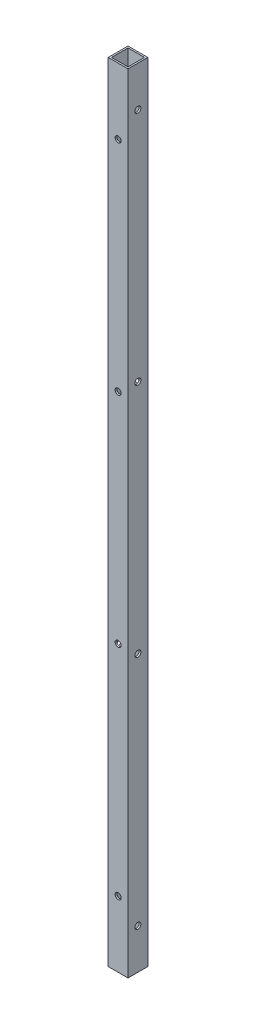
ISO-10303-21;
HEADER;
FILE_DESCRIPTION(('STEP AP214'),'2;1');
FILE_NAME('part.step','',(''),(''),'','','');
FILE_SCHEMA(('AUTOMOTIVE_DESIGN { 1 0 10303 214 1 1 1 1 }'));
ENDSEC;
DATA;
#1=APPLICATION_CONTEXT('core data for automotive mechanical design processes');
#2=APPLICATION_PROTOCOL_DEFINITION('international standard','automotive_design',2000,#1);
#3=PRODUCT_CONTEXT('',#1,'mechanical');
#4=PRODUCT('Part','Part','',(#3));
#5=PRODUCT_RELATED_PRODUCT_CATEGORY('part','',(#4));
#6=PRODUCT_DEFINITION_FORMATION('','',#4);
#7=PRODUCT_DEFINITION_CONTEXT('part definition',#1,'design');
#8=PRODUCT_DEFINITION('design','',#6,#7);
#9=PRODUCT_DEFINITION_SHAPE('','',#8);
#10=(LENGTH_UNIT() NAMED_UNIT(*) SI_UNIT(.MILLI.,.METRE.));
#11=(NAMED_UNIT(*) PLANE_ANGLE_UNIT() SI_UNIT($,.RADIAN.));
#12=(NAMED_UNIT(*) SI_UNIT($,.STERADIAN.) SOLID_ANGLE_UNIT());
#13=UNCERTAINTY_MEASURE_WITH_UNIT(LENGTH_MEASURE(1.E-05),#10,'distance_accuracy_value','');
#14=(GEOMETRIC_REPRESENTATION_CONTEXT(3) GLOBAL_UNCERTAINTY_ASSIGNED_CONTEXT((#13)) GLOBAL_UNIT_ASSIGNED_CONTEXT((#10,
#11,#12)) REPRESENTATION_CONTEXT('',''));
#15=CARTESIAN_POINT('',(0.,0.,0.));
#16=DIRECTION('',(0.,0.,1.));
#17=DIRECTION('',(1.,0.,0.));
#18=AXIS2_PLACEMENT_3D('',#15,#16,#17);
#19=CARTESIAN_POINT('',(9.52500000000001,38.8366000000001,0.));
#20=DIRECTION('',(-1.,0.,0.));
#21=DIRECTION('',(0.,0.,1.));
#22=AXIS2_PLACEMENT_3D('',#19,#20,#21);
#23=CYLINDRICAL_SURFACE('',#22,2.89559999999995);
#24=CARTESIAN_POINT('',(-7.9375,38.8366000000001,0.));
#25=DIRECTION('',(1.,0.,0.));
#26=DIRECTION('',(0.,0.,-1.));
#27=AXIS2_PLACEMENT_3D('',#24,#25,#26);
#28=CIRCLE('',#27,2.89559999999995);
#29=CARTESIAN_POINT('',(-7.9375,38.8366000000001,-2.89559999999994));
#30=VERTEX_POINT('',#29);
#31=EDGE_CURVE('E42',#30,#30,#28,.T.);
#32=ORIENTED_EDGE('',*,*,#31,.T.);
#33=EDGE_LOOP('',(#32));
#34=FACE_BOUND('',#33,.T.);
#35=CARTESIAN_POINT('',(-9.525,38.8366000000001,0.));
#36=DIRECTION('',(-1.,0.,0.));
#37=DIRECTION('',(0.,0.,1.));
#38=AXIS2_PLACEMENT_3D('',#35,#36,#37);
#39=CIRCLE('',#38,2.89559999999995);
#40=CARTESIAN_POINT('',(-9.525,38.8366000000001,2.89559999999995));
#41=VERTEX_POINT('',#40);
#42=EDGE_CURVE('E11',#41,#41,#39,.T.);
#43=ORIENTED_EDGE('',*,*,#42,.T.);
#44=EDGE_LOOP('',(#43));
#45=FACE_BOUND('',#44,.T.);
#46=ADVANCED_FACE('F35',(#34,#45),#23,.F.);
#47=CARTESIAN_POINT('',(9.52500000000001,265.921066666667,0.));
#48=DIRECTION('',(-1.,0.,0.));
#49=DIRECTION('',(0.,0.,1.));
#50=AXIS2_PLACEMENT_3D('',#47,#48,#49);
#51=CYLINDRICAL_SURFACE('',#50,2.89559999999995);
#52=CARTESIAN_POINT('',(-7.9375,265.921066666667,0.));
#53=DIRECTION('',(1.,0.,0.));
#54=DIRECTION('',(0.,0.,-1.));
#55=AXIS2_PLACEMENT_3D('',#52,#53,#54);
#56=CIRCLE('',#55,2.89559999999995);
#57=CARTESIAN_POINT('',(-7.9375,265.921066666667,-2.89559999999994));
#58=VERTEX_POINT('',#57);
#59=EDGE_CURVE('E214',#58,#58,#56,.T.);
#60=ORIENTED_EDGE('',*,*,#59,.T.);
#61=EDGE_LOOP('',(#60));
#62=FACE_BOUND('',#61,.T.);
#63=CARTESIAN_POINT('',(-9.525,265.921066666667,0.));
#64=DIRECTION('',(-1.,0.,0.));
#65=DIRECTION('',(0.,0.,1.));
#66=AXIS2_PLACEMENT_3D('',#63,#64,#65);
#67=CIRCLE('',#66,2.89559999999995);
#68=CARTESIAN_POINT('',(-9.525,265.921066666667,2.89559999999995));
#69=VERTEX_POINT('',#68);
#70=EDGE_CURVE('E217',#69,#69,#67,.T.);
#71=ORIENTED_EDGE('',*,*,#70,.T.);
#72=EDGE_LOOP('',(#71));
#73=FACE_BOUND('',#72,.T.);
#74=ADVANCED_FACE('F241',(#62,#73),#51,.F.);
#75=CARTESIAN_POINT('',(9.52500000000001,38.8366000000001,0.));
#76=DIRECTION('',(-1.,0.,0.));
#77=DIRECTION('',(0.,0.,1.));
#78=AXIS2_PLACEMENT_3D('',#75,#76,#77);
#79=CYLINDRICAL_SURFACE('',#78,2.89559999999995);
#80=CARTESIAN_POINT('',(7.9375,38.8366000000001,0.));
#81=DIRECTION('',(-1.,0.,0.));
#82=DIRECTION('',(0.,0.,1.));
#83=AXIS2_PLACEMENT_3D('',#80,#81,#82);
#84=CIRCLE('',#83,2.89559999999995);
#85=CARTESIAN_POINT('',(7.9375,38.8366000000001,2.89559999999995));
#86=VERTEX_POINT('',#85);
#87=EDGE_CURVE('E208',#86,#86,#84,.T.);
#88=ORIENTED_EDGE('',*,*,#87,.T.);
#89=EDGE_LOOP('',(#88));
#90=FACE_BOUND('',#89,.T.);
#91=CARTESIAN_POINT('',(9.52500000000001,38.8366000000001,0.));
#92=DIRECTION('',(-1.,0.,0.));
#93=DIRECTION('',(0.,0.,1.));
#94=AXIS2_PLACEMENT_3D('',#91,#92,#93);
#95=CIRCLE('',#94,2.89559999999995);
#96=CARTESIAN_POINT('',(9.52500000000001,38.8366000000001,2.89559999999995));
#97=VERTEX_POINT('',#96);
#98=EDGE_CURVE('E211',#97,#97,#95,.T.);
#99=ORIENTED_EDGE('',*,*,#98,.F.);
#100=EDGE_LOOP('',(#99));
#101=FACE_BOUND('',#100,.T.);
#102=ADVANCED_FACE('F245',(#90,#101),#79,.F.);
#103=CARTESIAN_POINT('',(9.52500000000001,265.921066666667,0.));
#104=DIRECTION('',(-1.,0.,0.));
#105=DIRECTION('',(0.,0.,1.));
#106=AXIS2_PLACEMENT_3D('',#103,#104,#105);
#107=CYLINDRICAL_SURFACE('',#106,2.89559999999995);
#108=CARTESIAN_POINT('',(7.9375,265.921066666667,0.));
#109=DIRECTION('',(-1.,0.,0.));
#110=DIRECTION('',(0.,0.,1.));
#111=AXIS2_PLACEMENT_3D('',#108,#109,#110);
#112=CIRCLE('',#111,2.89559999999995);
#113=CARTESIAN_POINT('',(7.9375,265.921066666667,2.89559999999995));
#114=VERTEX_POINT('',#113);
#115=EDGE_CURVE('E197',#114,#114,#112,.T.);
#116=ORIENTED_EDGE('',*,*,#115,.T.);
#117=EDGE_LOOP('',(#116));
#118=FACE_BOUND('',#117,.T.);
#119=CARTESIAN_POINT('',(9.52500000000001,265.921066666667,0.));
#120=DIRECTION('',(-1.,0.,0.));
#121=DIRECTION('',(0.,0.,1.));
#122=AXIS2_PLACEMENT_3D('',#119,#120,#121);
#123=CIRCLE('',#122,2.89559999999995);
#124=CARTESIAN_POINT('',(9.52500000000001,265.921066666667,2.89559999999995));
#125=VERTEX_POINT('',#124);
#126=EDGE_CURVE('E205',#125,#125,#123,.T.);
#127=ORIENTED_EDGE('',*,*,#126,.F.);
#128=EDGE_LOOP('',(#127));
#129=FACE_BOUND('',#128,.T.);
#130=ADVANCED_FACE('F250',(#118,#129),#107,.F.);
#131=CARTESIAN_POINT('',(0.,63.6015999999999,-9.525));
#132=DIRECTION('',(0.,0.,1.));
#133=DIRECTION('',(1.,0.,0.));
#134=AXIS2_PLACEMENT_3D('',#131,#132,#133);
#135=CYLINDRICAL_SURFACE('',#134,2.89559999999992);
#136=CARTESIAN_POINT('',(0.,63.6015999999999,7.93749999999999));
#137=DIRECTION('',(0.,0.,-1.));
#138=DIRECTION('',(-1.,0.,0.));
#139=AXIS2_PLACEMENT_3D('',#136,#137,#138);
#140=CIRCLE('',#139,2.89559999999992);
#141=CARTESIAN_POINT('',(-2.89559999999992,63.6015999999999,7.93749999999999));
#142=VERTEX_POINT('',#141);
#143=EDGE_CURVE('E191',#142,#142,#140,.T.);
#144=ORIENTED_EDGE('',*,*,#143,.T.);
#145=EDGE_LOOP('',(#144));
#146=FACE_BOUND('',#145,.T.);
#147=CARTESIAN_POINT('',(0.,63.6015999999999,9.525));
#148=DIRECTION('',(0.,0.,1.));
#149=DIRECTION('',(1.,0.,0.));
#150=AXIS2_PLACEMENT_3D('',#147,#148,#149);
#151=CIRCLE('',#150,2.89559999999992);
#152=CARTESIAN_POINT('',(2.89559999999992,63.6015999999999,9.525));
#153=VERTEX_POINT('',#152);
#154=EDGE_CURVE('E194',#153,#153,#151,.T.);
#155=ORIENTED_EDGE('',*,*,#154,.T.);
#156=EDGE_LOOP('',(#155));
#157=FACE_BOUND('',#156,.T.);
#158=ADVANCED_FACE('F257',(#146,#157),#135,.F.);
#159=CARTESIAN_POINT('',(0.,274.176066666667,-9.525));
#160=DIRECTION('',(0.,0.,1.));
#161=DIRECTION('',(1.,0.,0.));
#162=AXIS2_PLACEMENT_3D('',#159,#160,#161);
#163=CYLINDRICAL_SURFACE('',#162,2.89559999999992);
#164=CARTESIAN_POINT('',(0.,274.176066666667,7.93749999999999));
#165=DIRECTION('',(0.,0.,-1.));
#166=DIRECTION('',(-1.,0.,0.));
#167=AXIS2_PLACEMENT_3D('',#164,#165,#166);
#168=CIRCLE('',#167,2.89559999999992);
#169=CARTESIAN_POINT('',(-2.89559999999992,274.176066666667,7.93749999999999));
#170=VERTEX_POINT('',#169);
#171=EDGE_CURVE('E185',#170,#170,#168,.T.);
#172=ORIENTED_EDGE('',*,*,#171,.T.);
#173=EDGE_LOOP('',(#172));
#174=FACE_BOUND('',#173,.T.);
#175=CARTESIAN_POINT('',(0.,274.176066666667,9.525));
#176=DIRECTION('',(0.,0.,1.));
#177=DIRECTION('',(1.,0.,0.));
#178=AXIS2_PLACEMENT_3D('',#175,#176,#177);
#179=CIRCLE('',#178,2.89559999999992);
#180=CARTESIAN_POINT('',(2.89559999999992,274.176066666667,9.525));
#181=VERTEX_POINT('',#180);
#182=EDGE_CURVE('E188',#181,#181,#179,.T.);
#183=ORIENTED_EDGE('',*,*,#182,.T.);
#184=EDGE_LOOP('',(#183));
#185=FACE_BOUND('',#184,.T.);
#186=ADVANCED_FACE('F261',(#174,#185),#163,.F.);
#187=CARTESIAN_POINT('',(0.,63.6015999999999,-9.525));
#188=DIRECTION('',(0.,0.,1.));
#189=DIRECTION('',(1.,0.,0.));
#190=AXIS2_PLACEMENT_3D('',#187,#188,#189);
#191=CYLINDRICAL_SURFACE('',#190,2.89559999999992);
#192=CARTESIAN_POINT('',(0.,63.6015999999999,-7.9375));
#193=DIRECTION('',(0.,0.,1.));
#194=DIRECTION('',(1.,0.,0.));
#195=AXIS2_PLACEMENT_3D('',#192,#193,#194);
#196=CIRCLE('',#195,2.89559999999992);
#197=CARTESIAN_POINT('',(2.89559999999992,63.6015999999999,-7.9375));
#198=VERTEX_POINT('',#197);
#199=EDGE_CURVE('E179',#198,#198,#196,.T.);
#200=ORIENTED_EDGE('',*,*,#199,.T.);
#201=EDGE_LOOP('',(#200));
#202=FACE_BOUND('',#201,.T.);
#203=CARTESIAN_POINT('',(0.,63.6015999999999,-9.525));
#204=DIRECTION('',(0.,0.,1.));
#205=DIRECTION('',(1.,0.,0.));
#206=AXIS2_PLACEMENT_3D('',#203,#204,#205);
#207=CIRCLE('',#206,2.89559999999992);
#208=CARTESIAN_POINT('',(2.89559999999992,63.6015999999999,-9.525));
#209=VERTEX_POINT('',#208);
#210=EDGE_CURVE('E182',#209,#209,#207,.T.);
#211=ORIENTED_EDGE('',*,*,#210,.F.);
#212=EDGE_LOOP('',(#211));
#213=FACE_BOUND('',#212,.T.);
#214=ADVANCED_FACE('F265',(#202,#213),#191,.F.);
#215=CARTESIAN_POINT('',(0.,274.176066666667,-9.525));
#216=DIRECTION('',(0.,0.,1.));
#217=DIRECTION('',(1.,0.,0.));
#218=AXIS2_PLACEMENT_3D('',#215,#216,#217);
#219=CYLINDRICAL_SURFACE('',#218,2.89559999999992);
#220=CARTESIAN_POINT('',(0.,274.176066666667,-7.9375));
#221=DIRECTION('',(0.,0.,1.));
#222=DIRECTION('',(1.,0.,0.));
#223=AXIS2_PLACEMENT_3D('',#220,#221,#222);
#224=CIRCLE('',#223,2.89559999999992);
#225=CARTESIAN_POINT('',(2.89559999999992,274.176066666667,-7.9375));
#226=VERTEX_POINT('',#225);
#227=EDGE_CURVE('E169',#226,#226,#224,.T.);
#228=ORIENTED_EDGE('',*,*,#227,.T.);
#229=EDGE_LOOP('',(#228));
#230=FACE_BOUND('',#229,.T.);
#231=CARTESIAN_POINT('',(0.,274.176066666667,-9.525));
#232=DIRECTION('',(0.,0.,1.));
#233=DIRECTION('',(1.,0.,0.));
#234=AXIS2_PLACEMENT_3D('',#231,#232,#233);
#235=CIRCLE('',#234,2.89559999999992);
#236=CARTESIAN_POINT('',(2.89559999999992,274.176066666667,-9.525));
#237=VERTEX_POINT('',#236);
#238=EDGE_CURVE('E176',#237,#237,#235,.T.);
#239=ORIENTED_EDGE('',*,*,#238,.F.);
#240=EDGE_LOOP('',(#239));
#241=FACE_BOUND('',#240,.T.);
#242=ADVANCED_FACE('F269',(#230,#241),#219,.F.);
#243=CARTESIAN_POINT('',(0.,758.9266,0.));
#244=DIRECTION('',(0.,1.,0.));
#245=DIRECTION('',(0.,0.,1.));
#246=AXIS2_PLACEMENT_3D('',#243,#244,#245);
#247=PLANE('',#246);
#248=DIRECTION('',(0.,0.,-1.));
#249=VECTOR('',#248,1.);
#250=CARTESIAN_POINT('',(9.525,758.9266,-9.525));
#251=LINE('',#250,#249);
#252=CARTESIAN_POINT('',(9.525,758.9266,9.525));
#253=VERTEX_POINT('',#252);
#254=CARTESIAN_POINT('',(9.525,758.9266,-9.525));
#255=VERTEX_POINT('',#254);
#256=EDGE_CURVE('E140',#253,#255,#251,.T.);
#257=ORIENTED_EDGE('',*,*,#256,.T.);
#258=DIRECTION('',(-1.,0.,0.));
#259=VECTOR('',#258,1.);
#260=CARTESIAN_POINT('',(-9.525,758.9266,-9.525));
#261=LINE('',#260,#259);
#262=CARTESIAN_POINT('',(-9.525,758.9266,-9.525));
#263=VERTEX_POINT('',#262);
#264=EDGE_CURVE('E143',#255,#263,#261,.T.);
#265=ORIENTED_EDGE('',*,*,#264,.T.);
#266=DIRECTION('',(0.,0.,1.));
#267=VECTOR('',#266,1.);
#268=CARTESIAN_POINT('',(-9.525,758.9266,-9.525));
#269=LINE('',#268,#267);
#270=CARTESIAN_POINT('',(-9.525,758.9266,9.525));
#271=VERTEX_POINT('',#270);
#272=EDGE_CURVE('E146',#263,#271,#269,.T.);
#273=ORIENTED_EDGE('',*,*,#272,.T.);
#274=DIRECTION('',(1.,0.,0.));
#275=VECTOR('',#274,1.);
#276=CARTESIAN_POINT('',(-9.525,758.9266,9.525));
#277=LINE('',#276,#275);
#278=EDGE_CURVE('E148',#271,#253,#277,.T.);
#279=ORIENTED_EDGE('',*,*,#278,.T.);
#280=EDGE_LOOP('',(#257,#265,#273,#279));
#281=FACE_BOUND('',#280,.T.);
#282=DIRECTION('',(-1.,0.,0.));
#283=VECTOR('',#282,1.);
#284=CARTESIAN_POINT('',(-7.9375,758.9266,-7.9375));
#285=LINE('',#284,#283);
#286=CARTESIAN_POINT('',(7.9375,758.9266,-7.9375));
#287=VERTEX_POINT('',#286);
#288=CARTESIAN_POINT('',(-7.9375,758.9266,-7.9375));
#289=VERTEX_POINT('',#288);
#290=EDGE_CURVE('E108',#287,#289,#285,.T.);
#291=ORIENTED_EDGE('',*,*,#290,.F.);
#292=DIRECTION('',(0.,0.,-1.));
#293=VECTOR('',#292,1.);
#294=CARTESIAN_POINT('',(7.9375,758.9266,-7.9375));
#295=LINE('',#294,#293);
#296=CARTESIAN_POINT('',(7.9375,758.9266,7.9375));
#297=VERTEX_POINT('',#296);
#298=EDGE_CURVE('E99',#297,#287,#295,.T.);
#299=ORIENTED_EDGE('',*,*,#298,.F.);
#300=DIRECTION('',(1.,0.,0.));
#301=VECTOR('',#300,1.);
#302=CARTESIAN_POINT('',(-7.9375,758.9266,7.9375));
#303=LINE('',#302,#301);
#304=CARTESIAN_POINT('',(-7.9375,758.9266,7.9375));
#305=VERTEX_POINT('',#304);
#306=EDGE_CURVE('E124',#305,#297,#303,.T.);
#307=ORIENTED_EDGE('',*,*,#306,.F.);
#308=DIRECTION('',(0.,0.,1.));
#309=VECTOR('',#308,1.);
#310=CARTESIAN_POINT('',(-7.9375,758.9266,-7.9375));
#311=LINE('',#310,#309);
#312=EDGE_CURVE('E122',#289,#305,#311,.T.);
#313=ORIENTED_EDGE('',*,*,#312,.F.);
#314=EDGE_LOOP('',(#291,#299,#307,#313));
#315=FACE_BOUND('',#314,.T.);
#316=ADVANCED_FACE('F121',(#281,#315),#247,.T.);
#317=CARTESIAN_POINT('',(0.,0.,0.));
#318=DIRECTION('',(0.,1.,0.));
#319=DIRECTION('',(0.,0.,1.));
#320=AXIS2_PLACEMENT_3D('',#317,#318,#319);
#321=PLANE('',#320);
#322=DIRECTION('',(0.,0.,-1.));
#323=VECTOR('',#322,1.);
#324=CARTESIAN_POINT('',(9.525,0.,-9.525));
#325=LINE('',#324,#323);
#326=CARTESIAN_POINT('',(9.525,0.,9.525));
#327=VERTEX_POINT('',#326);
#328=CARTESIAN_POINT('',(9.525,0.,-9.525));
#329=VERTEX_POINT('',#328);
#330=EDGE_CURVE('E117',#327,#329,#325,.T.);
#331=ORIENTED_EDGE('',*,*,#330,.F.);
#332=DIRECTION('',(1.,0.,0.));
#333=VECTOR('',#332,1.);
#334=CARTESIAN_POINT('',(-9.525,0.,9.525));
#335=LINE('',#334,#333);
#336=CARTESIAN_POINT('',(-9.525,0.,9.525));
#337=VERTEX_POINT('',#336);
#338=EDGE_CURVE('E144',#337,#327,#335,.T.);
#339=ORIENTED_EDGE('',*,*,#338,.F.);
#340=DIRECTION('',(0.,0.,1.));
#341=VECTOR('',#340,1.);
#342=CARTESIAN_POINT('',(-9.525,0.,-9.525));
#343=LINE('',#342,#341);
#344=CARTESIAN_POINT('',(-9.525,0.,-9.525));
#345=VERTEX_POINT('',#344);
#346=EDGE_CURVE('E155',#345,#337,#343,.T.);
#347=ORIENTED_EDGE('',*,*,#346,.F.);
#348=DIRECTION('',(-1.,0.,0.));
#349=VECTOR('',#348,1.);
#350=CARTESIAN_POINT('',(-9.525,0.,-9.525));
#351=LINE('',#350,#349);
#352=EDGE_CURVE('E153',#329,#345,#351,.T.);
#353=ORIENTED_EDGE('',*,*,#352,.F.);
#354=EDGE_LOOP('',(#331,#339,#347,#353));
#355=FACE_BOUND('',#354,.T.);
#356=DIRECTION('',(0.,0.,-1.));
#357=VECTOR('',#356,1.);
#358=CARTESIAN_POINT('',(7.9375,0.,-7.9375));
#359=LINE('',#358,#357);
#360=CARTESIAN_POINT('',(7.9375,0.,7.9375));
#361=VERTEX_POINT('',#360);
#362=CARTESIAN_POINT('',(7.9375,0.,-7.9375));
#363=VERTEX_POINT('',#362);
#364=EDGE_CURVE('E57',#361,#363,#359,.T.);
#365=ORIENTED_EDGE('',*,*,#364,.T.);
#366=DIRECTION('',(-1.,0.,0.));
#367=VECTOR('',#366,1.);
#368=CARTESIAN_POINT('',(-7.9375,0.,-7.9375));
#369=LINE('',#368,#367);
#370=CARTESIAN_POINT('',(-7.9375,0.,-7.9375));
#371=VERTEX_POINT('',#370);
#372=EDGE_CURVE('E116',#363,#371,#369,.T.);
#373=ORIENTED_EDGE('',*,*,#372,.T.);
#374=DIRECTION('',(0.,0.,1.));
#375=VECTOR('',#374,1.);
#376=CARTESIAN_POINT('',(-7.9375,0.,-7.9375));
#377=LINE('',#376,#375);
#378=CARTESIAN_POINT('',(-7.9375,0.,7.9375));
#379=VERTEX_POINT('',#378);
#380=EDGE_CURVE('E132',#371,#379,#377,.T.);
#381=ORIENTED_EDGE('',*,*,#380,.T.);
#382=DIRECTION('',(1.,0.,0.));
#383=VECTOR('',#382,1.);
#384=CARTESIAN_POINT('',(-7.9375,0.,7.9375));
#385=LINE('',#384,#383);
#386=EDGE_CURVE('E109',#379,#361,#385,.T.);
#387=ORIENTED_EDGE('',*,*,#386,.T.);
#388=EDGE_LOOP('',(#365,#373,#381,#387));
#389=FACE_BOUND('',#388,.T.);
#390=ADVANCED_FACE('F278',(#355,#389),#321,.F.);
#391=CARTESIAN_POINT('',(9.525,758.9266,-9.525));
#392=DIRECTION('',(-1.,0.,0.));
#393=DIRECTION('',(0.,0.,1.));
#394=AXIS2_PLACEMENT_3D('',#391,#392,#393);
#395=PLANE('',#394);
#396=CARTESIAN_POINT('',(9.52500000000001,493.005533333333,0.));
#397=DIRECTION('',(-1.,0.,0.));
#398=DIRECTION('',(0.,0.,1.));
#399=AXIS2_PLACEMENT_3D('',#396,#397,#398);
#400=CIRCLE('',#399,2.89559999999995);
#401=CARTESIAN_POINT('',(9.52500000000001,493.005533333333,2.89559999999995));
#402=VERTEX_POINT('',#401);
#403=EDGE_CURVE('E418',#402,#402,#400,.T.);
#404=ORIENTED_EDGE('',*,*,#403,.T.);
#405=EDGE_LOOP('',(#404));
#406=FACE_BOUND('',#405,.T.);
#407=CARTESIAN_POINT('',(9.52500000000001,720.09,0.));
#408=DIRECTION('',(-1.,0.,0.));
#409=DIRECTION('',(0.,0.,1.));
#410=AXIS2_PLACEMENT_3D('',#407,#408,#409);
#411=CIRCLE('',#410,2.89559999999995);
#412=CARTESIAN_POINT('',(9.52500000000001,720.09,2.89559999999995));
#413=VERTEX_POINT('',#412);
#414=EDGE_CURVE('E202',#413,#413,#411,.T.);
#415=ORIENTED_EDGE('',*,*,#414,.T.);
#416=EDGE_LOOP('',(#415));
#417=FACE_BOUND('',#416,.T.);
#418=ORIENTED_EDGE('',*,*,#330,.T.);
#419=DIRECTION('',(0.,-1.,0.));
#420=VECTOR('',#419,1.);
#421=CARTESIAN_POINT('',(9.525,758.9266,-9.525));
#422=LINE('',#421,#420);
#423=EDGE_CURVE('E166',#255,#329,#422,.T.);
#424=ORIENTED_EDGE('',*,*,#423,.F.);
#425=ORIENTED_EDGE('',*,*,#256,.F.);
#426=DIRECTION('',(0.,-1.,0.));
#427=VECTOR('',#426,1.);
#428=CARTESIAN_POINT('',(9.525,758.9266,9.525));
#429=LINE('',#428,#427);
#430=EDGE_CURVE('E150',#253,#327,#429,.T.);
#431=ORIENTED_EDGE('',*,*,#430,.T.);
#432=EDGE_LOOP('',(#418,#424,#425,#431));
#433=FACE_BOUND('',#432,.T.);
#434=ORIENTED_EDGE('',*,*,#126,.T.);
#435=EDGE_LOOP('',(#434));
#436=FACE_BOUND('',#435,.T.);
#437=ORIENTED_EDGE('',*,*,#98,.T.);
#438=EDGE_LOOP('',(#437));
#439=FACE_BOUND('',#438,.T.);
#440=ADVANCED_FACE('F274',(#406,#417,#433,#436,#439),#395,.F.);
#441=CARTESIAN_POINT('',(-9.525,758.9266,-9.525));
#442=DIRECTION('',(0.,0.,1.));
#443=DIRECTION('',(1.,0.,0.));
#444=AXIS2_PLACEMENT_3D('',#441,#442,#443);
#445=PLANE('',#444);
#446=CARTESIAN_POINT('',(0.,484.750533333333,-9.525));
#447=DIRECTION('',(0.,0.,1.));
#448=DIRECTION('',(1.,0.,0.));
#449=AXIS2_PLACEMENT_3D('',#446,#447,#448);
#450=CIRCLE('',#449,2.89559999999992);
#451=CARTESIAN_POINT('',(2.89559999999992,484.750533333333,-9.525));
#452=VERTEX_POINT('',#451);
#453=EDGE_CURVE('E322',#452,#452,#450,.T.);
#454=ORIENTED_EDGE('',*,*,#453,.T.);
#455=EDGE_LOOP('',(#454));
#456=FACE_BOUND('',#455,.T.);
#457=CARTESIAN_POINT('',(0.,695.325,-9.525));
#458=DIRECTION('',(0.,0.,1.));
#459=DIRECTION('',(1.,0.,0.));
#460=AXIS2_PLACEMENT_3D('',#457,#458,#459);
#461=CIRCLE('',#460,2.89559999999992);
#462=CARTESIAN_POINT('',(2.89559999999992,695.325,-9.525));
#463=VERTEX_POINT('',#462);
#464=EDGE_CURVE('E173',#463,#463,#461,.T.);
#465=ORIENTED_EDGE('',*,*,#464,.T.);
#466=EDGE_LOOP('',(#465));
#467=FACE_BOUND('',#466,.T.);
#468=ORIENTED_EDGE('',*,*,#352,.T.);
#469=DIRECTION('',(0.,-1.,0.));
#470=VECTOR('',#469,1.);
#471=CARTESIAN_POINT('',(-9.525,758.9266,-9.525));
#472=LINE('',#471,#470);
#473=EDGE_CURVE('E163',#263,#345,#472,.T.);
#474=ORIENTED_EDGE('',*,*,#473,.F.);
#475=ORIENTED_EDGE('',*,*,#264,.F.);
#476=ORIENTED_EDGE('',*,*,#423,.T.);
#477=EDGE_LOOP('',(#468,#474,#475,#476));
#478=FACE_BOUND('',#477,.T.);
#479=ORIENTED_EDGE('',*,*,#238,.T.);
#480=EDGE_LOOP('',(#479));
#481=FACE_BOUND('',#480,.T.);
#482=ORIENTED_EDGE('',*,*,#210,.T.);
#483=EDGE_LOOP('',(#482));
#484=FACE_BOUND('',#483,.T.);
#485=ADVANCED_FACE('F277',(#456,#467,#478,#481,#484),#445,.F.);
#486=CARTESIAN_POINT('',(-9.525,758.9266,-9.525));
#487=DIRECTION('',(1.,0.,0.));
#488=DIRECTION('',(0.,0.,-1.));
#489=AXIS2_PLACEMENT_3D('',#486,#487,#488);
#490=PLANE('',#489);
#491=CARTESIAN_POINT('',(-9.525,493.005533333333,0.));
#492=DIRECTION('',(-1.,0.,0.));
#493=DIRECTION('',(0.,0.,1.));
#494=AXIS2_PLACEMENT_3D('',#491,#492,#493);
#495=CIRCLE('',#494,2.89559999999995);
#496=CARTESIAN_POINT('',(-9.525,493.005533333333,2.89559999999995));
#497=VERTEX_POINT('',#496);
#498=EDGE_CURVE('E416',#497,#497,#495,.T.);
#499=ORIENTED_EDGE('',*,*,#498,.F.);
#500=EDGE_LOOP('',(#499));
#501=FACE_BOUND('',#500,.T.);
#502=CARTESIAN_POINT('',(-9.525,720.09,0.));
#503=DIRECTION('',(-1.,0.,0.));
#504=DIRECTION('',(0.,0.,1.));
#505=AXIS2_PLACEMENT_3D('',#502,#503,#504);
#506=CIRCLE('',#505,2.89559999999995);
#507=CARTESIAN_POINT('',(-9.525,720.09,2.89559999999995));
#508=VERTEX_POINT('',#507);
#509=EDGE_CURVE('E314',#508,#508,#506,.T.);
#510=ORIENTED_EDGE('',*,*,#509,.F.);
#511=EDGE_LOOP('',(#510));
#512=FACE_BOUND('',#511,.T.);
#513=ORIENTED_EDGE('',*,*,#346,.T.);
#514=DIRECTION('',(0.,-1.,0.));
#515=VECTOR('',#514,1.);
#516=CARTESIAN_POINT('',(-9.525,758.9266,9.525));
#517=LINE('',#516,#515);
#518=EDGE_CURVE('E160',#271,#337,#517,.T.);
#519=ORIENTED_EDGE('',*,*,#518,.F.);
#520=ORIENTED_EDGE('',*,*,#272,.F.);
#521=ORIENTED_EDGE('',*,*,#473,.T.);
#522=EDGE_LOOP('',(#513,#519,#520,#521));
#523=FACE_BOUND('',#522,.T.);
#524=ORIENTED_EDGE('',*,*,#70,.F.);
#525=EDGE_LOOP('',(#524));
#526=FACE_BOUND('',#525,.T.);
#527=ORIENTED_EDGE('',*,*,#42,.F.);
#528=EDGE_LOOP('',(#527));
#529=FACE_BOUND('',#528,.T.);
#530=ADVANCED_FACE('F282',(#501,#512,#523,#526,#529),#490,.F.);
#531=CARTESIAN_POINT('',(-9.525,758.9266,9.525));
#532=DIRECTION('',(0.,0.,-1.));
#533=DIRECTION('',(-1.,0.,0.));
#534=AXIS2_PLACEMENT_3D('',#531,#532,#533);
#535=PLANE('',#534);
#536=CARTESIAN_POINT('',(0.,484.750533333333,9.525));
#537=DIRECTION('',(0.,0.,1.));
#538=DIRECTION('',(1.,0.,0.));
#539=AXIS2_PLACEMENT_3D('',#536,#537,#538);
#540=CIRCLE('',#539,2.89559999999992);
#541=CARTESIAN_POINT('',(2.89559999999992,484.750533333333,9.525));
#542=VERTEX_POINT('',#541);
#543=EDGE_CURVE('E311',#542,#542,#540,.T.);
#544=ORIENTED_EDGE('',*,*,#543,.F.);
#545=EDGE_LOOP('',(#544));
#546=FACE_BOUND('',#545,.T.);
#547=CARTESIAN_POINT('',(0.,695.325,9.525));
#548=DIRECTION('',(0.,0.,1.));
#549=DIRECTION('',(1.,0.,0.));
#550=AXIS2_PLACEMENT_3D('',#547,#548,#549);
#551=CIRCLE('',#550,2.89559999999992);
#552=CARTESIAN_POINT('',(2.89559999999992,695.325,9.525));
#553=VERTEX_POINT('',#552);
#554=EDGE_CURVE('E325',#553,#553,#551,.T.);
#555=ORIENTED_EDGE('',*,*,#554,.F.);
#556=EDGE_LOOP('',(#555));
#557=FACE_BOUND('',#556,.T.);
#558=ORIENTED_EDGE('',*,*,#338,.T.);
#559=ORIENTED_EDGE('',*,*,#430,.F.);
#560=ORIENTED_EDGE('',*,*,#278,.F.);
#561=ORIENTED_EDGE('',*,*,#518,.T.);
#562=EDGE_LOOP('',(#558,#559,#560,#561));
#563=FACE_BOUND('',#562,.T.);
#564=ORIENTED_EDGE('',*,*,#182,.F.);
#565=EDGE_LOOP('',(#564));
#566=FACE_BOUND('',#565,.T.);
#567=ORIENTED_EDGE('',*,*,#154,.F.);
#568=EDGE_LOOP('',(#567));
#569=FACE_BOUND('',#568,.T.);
#570=ADVANCED_FACE('F286',(#546,#557,#563,#566,#569),#535,.F.);
#571=CARTESIAN_POINT('',(7.9375,758.9266,-7.9375));
#572=DIRECTION('',(-1.,0.,0.));
#573=DIRECTION('',(0.,0.,1.));
#574=AXIS2_PLACEMENT_3D('',#571,#572,#573);
#575=PLANE('',#574);
#576=CARTESIAN_POINT('',(7.9375,493.005533333333,0.));
#577=DIRECTION('',(-1.,0.,0.));
#578=DIRECTION('',(0.,0.,1.));
#579=AXIS2_PLACEMENT_3D('',#576,#577,#578);
#580=CIRCLE('',#579,2.89559999999995);
#581=CARTESIAN_POINT('',(7.9375,493.005533333333,2.89559999999995));
#582=VERTEX_POINT('',#581);
#583=EDGE_CURVE('E304',#582,#582,#580,.T.);
#584=ORIENTED_EDGE('',*,*,#583,.F.);
#585=EDGE_LOOP('',(#584));
#586=FACE_BOUND('',#585,.T.);
#587=CARTESIAN_POINT('',(7.9375,720.09,0.));
#588=DIRECTION('',(-1.,0.,0.));
#589=DIRECTION('',(0.,0.,1.));
#590=AXIS2_PLACEMENT_3D('',#587,#588,#589);
#591=CIRCLE('',#590,2.89559999999995);
#592=CARTESIAN_POINT('',(7.9375,720.09,2.89559999999995));
#593=VERTEX_POINT('',#592);
#594=EDGE_CURVE('E201',#593,#593,#591,.T.);
#595=ORIENTED_EDGE('',*,*,#594,.F.);
#596=EDGE_LOOP('',(#595));
#597=FACE_BOUND('',#596,.T.);
#598=ORIENTED_EDGE('',*,*,#364,.F.);
#599=DIRECTION('',(0.,-1.,0.));
#600=VECTOR('',#599,1.);
#601=CARTESIAN_POINT('',(7.9375,758.9266,7.9375));
#602=LINE('',#601,#600);
#603=EDGE_CURVE('E104',#297,#361,#602,.T.);
#604=ORIENTED_EDGE('',*,*,#603,.F.);
#605=ORIENTED_EDGE('',*,*,#298,.T.);
#606=DIRECTION('',(0.,-1.,0.));
#607=VECTOR('',#606,1.);
#608=CARTESIAN_POINT('',(7.9375,758.9266,-7.9375));
#609=LINE('',#608,#607);
#610=EDGE_CURVE('E103',#287,#363,#609,.T.);
#611=ORIENTED_EDGE('',*,*,#610,.T.);
#612=EDGE_LOOP('',(#598,#604,#605,#611));
#613=FACE_BOUND('',#612,.T.);
#614=ORIENTED_EDGE('',*,*,#115,.F.);
#615=EDGE_LOOP('',(#614));
#616=FACE_BOUND('',#615,.T.);
#617=ORIENTED_EDGE('',*,*,#87,.F.);
#618=EDGE_LOOP('',(#617));
#619=FACE_BOUND('',#618,.T.);
#620=ADVANCED_FACE('F101',(#586,#597,#613,#616,#619),#575,.T.);
#621=CARTESIAN_POINT('',(-7.9375,758.9266,-7.9375));
#622=DIRECTION('',(0.,0.,1.));
#623=DIRECTION('',(1.,0.,0.));
#624=AXIS2_PLACEMENT_3D('',#621,#622,#623);
#625=PLANE('',#624);
#626=CARTESIAN_POINT('',(0.,484.750533333333,-7.9375));
#627=DIRECTION('',(0.,0.,1.));
#628=DIRECTION('',(1.,0.,0.));
#629=AXIS2_PLACEMENT_3D('',#626,#627,#628);
#630=CIRCLE('',#629,2.89559999999992);
#631=CARTESIAN_POINT('',(2.89559999999992,484.750533333333,-7.9375));
#632=VERTEX_POINT('',#631);
#633=EDGE_CURVE('E319',#632,#632,#630,.T.);
#634=ORIENTED_EDGE('',*,*,#633,.F.);
#635=EDGE_LOOP('',(#634));
#636=FACE_BOUND('',#635,.T.);
#637=CARTESIAN_POINT('',(0.,695.325,-7.9375));
#638=DIRECTION('',(0.,0.,1.));
#639=DIRECTION('',(1.,0.,0.));
#640=AXIS2_PLACEMENT_3D('',#637,#638,#639);
#641=CIRCLE('',#640,2.89559999999992);
#642=CARTESIAN_POINT('',(2.89559999999992,695.325,-7.9375));
#643=VERTEX_POINT('',#642);
#644=EDGE_CURVE('E130',#643,#643,#641,.T.);
#645=ORIENTED_EDGE('',*,*,#644,.F.);
#646=EDGE_LOOP('',(#645));
#647=FACE_BOUND('',#646,.T.);
#648=ORIENTED_EDGE('',*,*,#372,.F.);
#649=ORIENTED_EDGE('',*,*,#610,.F.);
#650=ORIENTED_EDGE('',*,*,#290,.T.);
#651=DIRECTION('',(0.,-1.,0.));
#652=VECTOR('',#651,1.);
#653=CARTESIAN_POINT('',(-7.9375,758.9266,-7.9375));
#654=LINE('',#653,#652);
#655=EDGE_CURVE('E118',#289,#371,#654,.T.);
#656=ORIENTED_EDGE('',*,*,#655,.T.);
#657=EDGE_LOOP('',(#648,#649,#650,#656));
#658=FACE_BOUND('',#657,.T.);
#659=ORIENTED_EDGE('',*,*,#227,.F.);
#660=EDGE_LOOP('',(#659));
#661=FACE_BOUND('',#660,.T.);
#662=ORIENTED_EDGE('',*,*,#199,.F.);
#663=EDGE_LOOP('',(#662));
#664=FACE_BOUND('',#663,.T.);
#665=ADVANCED_FACE('F112',(#636,#647,#658,#661,#664),#625,.T.);
#666=CARTESIAN_POINT('',(-7.9375,758.9266,-7.9375));
#667=DIRECTION('',(1.,0.,0.));
#668=DIRECTION('',(0.,0.,-1.));
#669=AXIS2_PLACEMENT_3D('',#666,#667,#668);
#670=PLANE('',#669);
#671=CARTESIAN_POINT('',(-7.9375,493.005533333333,0.));
#672=DIRECTION('',(1.,0.,0.));
#673=DIRECTION('',(0.,0.,-1.));
#674=AXIS2_PLACEMENT_3D('',#671,#672,#673);
#675=CIRCLE('',#674,2.89559999999995);
#676=CARTESIAN_POINT('',(-7.9375,493.005533333333,-2.89559999999994));
#677=VERTEX_POINT('',#676);
#678=EDGE_CURVE('E413',#677,#677,#675,.T.);
#679=ORIENTED_EDGE('',*,*,#678,.F.);
#680=EDGE_LOOP('',(#679));
#681=FACE_BOUND('',#680,.T.);
#682=CARTESIAN_POINT('',(-7.9375,720.09,0.));
#683=DIRECTION('',(1.,0.,0.));
#684=DIRECTION('',(0.,0.,-1.));
#685=AXIS2_PLACEMENT_3D('',#682,#683,#684);
#686=CIRCLE('',#685,2.89559999999995);
#687=CARTESIAN_POINT('',(-7.9375,720.09,-2.89559999999994));
#688=VERTEX_POINT('',#687);
#689=EDGE_CURVE('E198',#688,#688,#686,.T.);
#690=ORIENTED_EDGE('',*,*,#689,.F.);
#691=EDGE_LOOP('',(#690));
#692=FACE_BOUND('',#691,.T.);
#693=ORIENTED_EDGE('',*,*,#380,.F.);
#694=ORIENTED_EDGE('',*,*,#655,.F.);
#695=ORIENTED_EDGE('',*,*,#312,.T.);
#696=DIRECTION('',(0.,-1.,0.));
#697=VECTOR('',#696,1.);
#698=CARTESIAN_POINT('',(-7.9375,758.9266,7.9375));
#699=LINE('',#698,#697);
#700=EDGE_CURVE('E49',#305,#379,#699,.T.);
#701=ORIENTED_EDGE('',*,*,#700,.T.);
#702=EDGE_LOOP('',(#693,#694,#695,#701));
#703=FACE_BOUND('',#702,.T.);
#704=ORIENTED_EDGE('',*,*,#59,.F.);
#705=EDGE_LOOP('',(#704));
#706=FACE_BOUND('',#705,.T.);
#707=ORIENTED_EDGE('',*,*,#31,.F.);
#708=EDGE_LOOP('',(#707));
#709=FACE_BOUND('',#708,.T.);
#710=ADVANCED_FACE('F224',(#681,#692,#703,#706,#709),#670,.T.);
#711=CARTESIAN_POINT('',(-7.9375,758.9266,7.9375));
#712=DIRECTION('',(0.,0.,-1.));
#713=DIRECTION('',(-1.,0.,0.));
#714=AXIS2_PLACEMENT_3D('',#711,#712,#713);
#715=PLANE('',#714);
#716=CARTESIAN_POINT('',(0.,484.750533333333,7.93749999999999));
#717=DIRECTION('',(0.,0.,-1.));
#718=DIRECTION('',(-1.,0.,0.));
#719=AXIS2_PLACEMENT_3D('',#716,#717,#718);
#720=CIRCLE('',#719,2.89559999999992);
#721=CARTESIAN_POINT('',(-2.89559999999992,484.750533333333,7.93749999999999));
#722=VERTEX_POINT('',#721);
#723=EDGE_CURVE('E308',#722,#722,#720,.T.);
#724=ORIENTED_EDGE('',*,*,#723,.F.);
#725=EDGE_LOOP('',(#724));
#726=FACE_BOUND('',#725,.T.);
#727=CARTESIAN_POINT('',(0.,695.325,7.93749999999999));
#728=DIRECTION('',(0.,0.,-1.));
#729=DIRECTION('',(-1.,0.,0.));
#730=AXIS2_PLACEMENT_3D('',#727,#728,#729);
#731=CIRCLE('',#730,2.89559999999992);
#732=CARTESIAN_POINT('',(-2.89559999999992,695.325,7.93749999999999));
#733=VERTEX_POINT('',#732);
#734=EDGE_CURVE('E170',#733,#733,#731,.T.);
#735=ORIENTED_EDGE('',*,*,#734,.F.);
#736=EDGE_LOOP('',(#735));
#737=FACE_BOUND('',#736,.T.);
#738=ORIENTED_EDGE('',*,*,#386,.F.);
#739=ORIENTED_EDGE('',*,*,#700,.F.);
#740=ORIENTED_EDGE('',*,*,#306,.T.);
#741=ORIENTED_EDGE('',*,*,#603,.T.);
#742=EDGE_LOOP('',(#738,#739,#740,#741));
#743=FACE_BOUND('',#742,.T.);
#744=ORIENTED_EDGE('',*,*,#171,.F.);
#745=EDGE_LOOP('',(#744));
#746=FACE_BOUND('',#745,.T.);
#747=ORIENTED_EDGE('',*,*,#143,.F.);
#748=EDGE_LOOP('',(#747));
#749=FACE_BOUND('',#748,.T.);
#750=ADVANCED_FACE('F226',(#726,#737,#743,#746,#749),#715,.T.);
#751=CARTESIAN_POINT('',(0.,695.325,-9.525));
#752=DIRECTION('',(0.,0.,1.));
#753=DIRECTION('',(1.,0.,0.));
#754=AXIS2_PLACEMENT_3D('',#751,#752,#753);
#755=CYLINDRICAL_SURFACE('',#754,2.89559999999992);
#756=ORIENTED_EDGE('',*,*,#734,.T.);
#757=EDGE_LOOP('',(#756));
#758=FACE_BOUND('',#757,.T.);
#759=ORIENTED_EDGE('',*,*,#554,.T.);
#760=EDGE_LOOP('',(#759));
#761=FACE_BOUND('',#760,.T.);
#762=ADVANCED_FACE('F233',(#758,#761),#755,.F.);
#763=ORIENTED_EDGE('',*,*,#644,.T.);
#764=EDGE_LOOP('',(#763));
#765=FACE_BOUND('',#764,.T.);
#766=ORIENTED_EDGE('',*,*,#464,.F.);
#767=EDGE_LOOP('',(#766));
#768=FACE_BOUND('',#767,.T.);
#769=ADVANCED_FACE('F332',(#765,#768),#755,.F.);
#770=CARTESIAN_POINT('',(0.,484.750533333333,-9.525));
#771=DIRECTION('',(0.,0.,1.));
#772=DIRECTION('',(1.,0.,0.));
#773=AXIS2_PLACEMENT_3D('',#770,#771,#772);
#774=CYLINDRICAL_SURFACE('',#773,2.89559999999992);
#775=ORIENTED_EDGE('',*,*,#633,.T.);
#776=EDGE_LOOP('',(#775));
#777=FACE_BOUND('',#776,.T.);
#778=ORIENTED_EDGE('',*,*,#453,.F.);
#779=EDGE_LOOP('',(#778));
#780=FACE_BOUND('',#779,.T.);
#781=ADVANCED_FACE('F336',(#777,#780),#774,.F.);
#782=CARTESIAN_POINT('',(0.,484.750533333333,-9.525));
#783=DIRECTION('',(0.,0.,1.));
#784=DIRECTION('',(1.,0.,0.));
#785=AXIS2_PLACEMENT_3D('',#782,#783,#784);
#786=CYLINDRICAL_SURFACE('',#785,2.89559999999992);
#787=ORIENTED_EDGE('',*,*,#723,.T.);
#788=EDGE_LOOP('',(#787));
#789=FACE_BOUND('',#788,.T.);
#790=ORIENTED_EDGE('',*,*,#543,.T.);
#791=EDGE_LOOP('',(#790));
#792=FACE_BOUND('',#791,.T.);
#793=ADVANCED_FACE('F389',(#789,#792),#786,.F.);
#794=CARTESIAN_POINT('',(9.52500000000001,720.09,0.));
#795=DIRECTION('',(-1.,0.,0.));
#796=DIRECTION('',(0.,0.,1.));
#797=AXIS2_PLACEMENT_3D('',#794,#795,#796);
#798=CYLINDRICAL_SURFACE('',#797,2.89559999999995);
#799=ORIENTED_EDGE('',*,*,#689,.T.);
#800=EDGE_LOOP('',(#799));
#801=FACE_BOUND('',#800,.T.);
#802=ORIENTED_EDGE('',*,*,#509,.T.);
#803=EDGE_LOOP('',(#802));
#804=FACE_BOUND('',#803,.T.);
#805=ADVANCED_FACE('F396',(#801,#804),#798,.F.);
#806=ORIENTED_EDGE('',*,*,#594,.T.);
#807=EDGE_LOOP('',(#806));
#808=FACE_BOUND('',#807,.T.);
#809=ORIENTED_EDGE('',*,*,#414,.F.);
#810=EDGE_LOOP('',(#809));
#811=FACE_BOUND('',#810,.T.);
#812=ADVANCED_FACE('F400',(#808,#811),#798,.F.);
#813=CARTESIAN_POINT('',(9.52500000000001,493.005533333333,0.));
#814=DIRECTION('',(-1.,0.,0.));
#815=DIRECTION('',(0.,0.,1.));
#816=AXIS2_PLACEMENT_3D('',#813,#814,#815);
#817=CYLINDRICAL_SURFACE('',#816,2.89559999999995);
#818=ORIENTED_EDGE('',*,*,#583,.T.);
#819=EDGE_LOOP('',(#818));
#820=FACE_BOUND('',#819,.T.);
#821=ORIENTED_EDGE('',*,*,#403,.F.);
#822=EDGE_LOOP('',(#821));
#823=FACE_BOUND('',#822,.T.);
#824=ADVANCED_FACE('F402',(#820,#823),#817,.F.);
#825=CARTESIAN_POINT('',(9.52500000000001,493.005533333333,0.));
#826=DIRECTION('',(-1.,0.,0.));
#827=DIRECTION('',(0.,0.,1.));
#828=AXIS2_PLACEMENT_3D('',#825,#826,#827);
#829=CYLINDRICAL_SURFACE('',#828,2.89559999999995);
#830=ORIENTED_EDGE('',*,*,#678,.T.);
#831=EDGE_LOOP('',(#830));
#832=FACE_BOUND('',#831,.T.);
#833=ORIENTED_EDGE('',*,*,#498,.T.);
#834=EDGE_LOOP('',(#833));
#835=FACE_BOUND('',#834,.T.);
#836=ADVANCED_FACE('F405',(#832,#835),#829,.F.);
#837=CLOSED_SHELL('',(#46,#74,#102,#130,#158,#186,#214,#242,#316,#390,#440,#485,#530,#570,#620,
#665,#710,#750,#762,#769,#781,#793,#805,#812,#824,#836));
#838=MANIFOLD_SOLID_BREP('B2',#837);
#839=ADVANCED_BREP_SHAPE_REPRESENTATION('',(#18,#838),#14);
#840=SHAPE_DEFINITION_REPRESENTATION(#9,#839);
ENDSEC;
END-ISO-10303-21;
